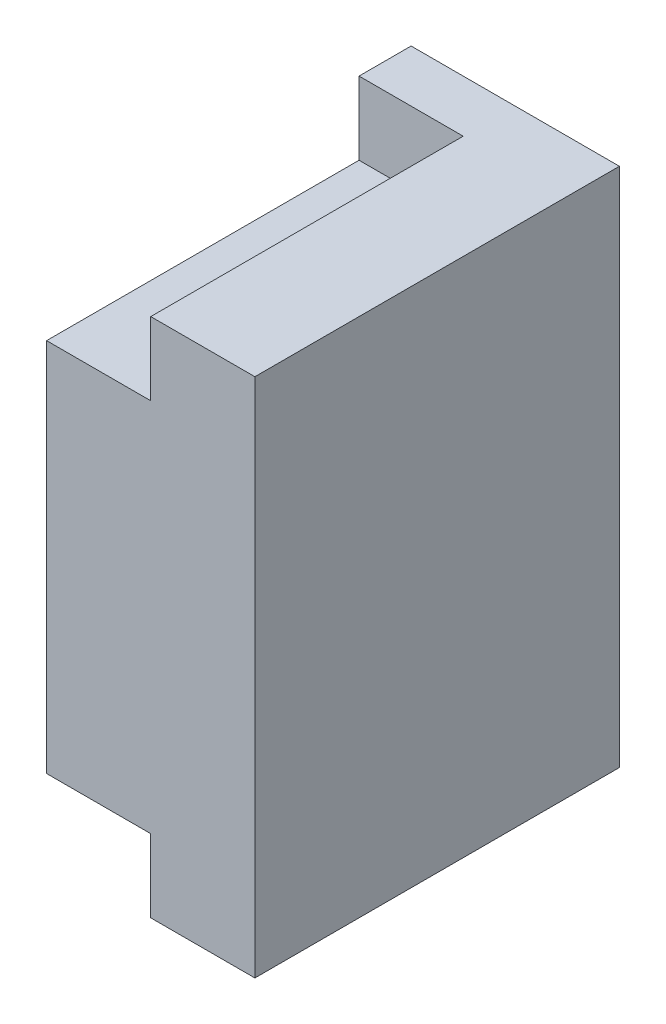
ISO-10303-21;
HEADER;
FILE_DESCRIPTION(('STEP AP214'),'2;1');
FILE_NAME('part.step','',(''),(''),'','','');
FILE_SCHEMA(('AUTOMOTIVE_DESIGN { 1 0 10303 214 1 1 1 1 }'));
ENDSEC;
DATA;
#1=APPLICATION_CONTEXT('core data for automotive mechanical design processes');
#2=APPLICATION_PROTOCOL_DEFINITION('international standard','automotive_design',2000,#1);
#3=PRODUCT_CONTEXT('',#1,'mechanical');
#4=PRODUCT('Part','Part','',(#3));
#5=PRODUCT_RELATED_PRODUCT_CATEGORY('part','',(#4));
#6=PRODUCT_DEFINITION_FORMATION('','',#4);
#7=PRODUCT_DEFINITION_CONTEXT('part definition',#1,'design');
#8=PRODUCT_DEFINITION('design','',#6,#7);
#9=PRODUCT_DEFINITION_SHAPE('','',#8);
#10=(LENGTH_UNIT() NAMED_UNIT(*) SI_UNIT(.MILLI.,.METRE.));
#11=(NAMED_UNIT(*) PLANE_ANGLE_UNIT() SI_UNIT($,.RADIAN.));
#12=(NAMED_UNIT(*) SI_UNIT($,.STERADIAN.) SOLID_ANGLE_UNIT());
#13=UNCERTAINTY_MEASURE_WITH_UNIT(LENGTH_MEASURE(1.E-05),#10,'distance_accuracy_value','');
#14=(GEOMETRIC_REPRESENTATION_CONTEXT(3) GLOBAL_UNCERTAINTY_ASSIGNED_CONTEXT((#13)) GLOBAL_UNIT_ASSIGNED_CONTEXT((#10,
#11,#12)) REPRESENTATION_CONTEXT('',''));
#15=CARTESIAN_POINT('',(0.,0.,0.));
#16=DIRECTION('',(0.,0.,1.));
#17=DIRECTION('',(1.,0.,0.));
#18=AXIS2_PLACEMENT_3D('',#15,#16,#17);
#19=CARTESIAN_POINT('',(0.3,-0.25,0.));
#20=DIRECTION('',(1.,0.,0.));
#21=DIRECTION('',(0.,0.,1.));
#22=AXIS2_PLACEMENT_3D('',#19,#20,#21);
#23=PLANE('',#22);
#24=DIRECTION('',(0.,-1.,0.));
#25=VECTOR('',#24,1.);
#26=CARTESIAN_POINT('',(0.3,-0.25,0.05));
#27=LINE('',#26,#25);
#28=CARTESIAN_POINT('',(0.3,-0.18,0.05));
#29=VERTEX_POINT('',#28);
#30=CARTESIAN_POINT('',(0.3,-0.25,0.05));
#31=VERTEX_POINT('',#30);
#32=EDGE_CURVE('E11',#29,#31,#27,.T.);
#33=ORIENTED_EDGE('',*,*,#32,.F.);
#34=DIRECTION('',(0.,0.,1.));
#35=VECTOR('',#34,1.);
#36=CARTESIAN_POINT('',(0.3,-0.18,0.025));
#37=LINE('',#36,#35);
#38=CARTESIAN_POINT('',(0.3,-0.18,0.35));
#39=VERTEX_POINT('',#38);
#40=EDGE_CURVE('E24',#29,#39,#37,.T.);
#41=ORIENTED_EDGE('',*,*,#40,.T.);
#42=DIRECTION('',(0.,1.,0.));
#43=VECTOR('',#42,1.);
#44=CARTESIAN_POINT('',(0.3,-0.25,0.35));
#45=LINE('',#44,#43);
#46=CARTESIAN_POINT('',(0.3,0.18,0.35));
#47=VERTEX_POINT('',#46);
#48=EDGE_CURVE('E168',#39,#47,#45,.T.);
#49=ORIENTED_EDGE('',*,*,#48,.T.);
#50=DIRECTION('',(0.,0.,1.));
#51=VECTOR('',#50,1.);
#52=CARTESIAN_POINT('',(0.3,0.18,0.025));
#53=LINE('',#52,#51);
#54=CARTESIAN_POINT('',(0.3,0.18,0.05));
#55=VERTEX_POINT('',#54);
#56=EDGE_CURVE('E166',#55,#47,#53,.T.);
#57=ORIENTED_EDGE('',*,*,#56,.F.);
#58=DIRECTION('',(0.,-1.,0.));
#59=VECTOR('',#58,1.);
#60=CARTESIAN_POINT('',(0.3,-0.035,0.05));
#61=LINE('',#60,#59);
#62=CARTESIAN_POINT('',(0.3,0.25,0.05));
#63=VERTEX_POINT('',#62);
#64=EDGE_CURVE('E164',#63,#55,#61,.T.);
#65=ORIENTED_EDGE('',*,*,#64,.F.);
#66=DIRECTION('',(0.,0.,1.));
#67=VECTOR('',#66,1.);
#68=CARTESIAN_POINT('',(0.3,0.25,0.));
#69=LINE('',#68,#67);
#70=CARTESIAN_POINT('',(0.3,0.25,0.));
#71=VERTEX_POINT('',#70);
#72=EDGE_CURVE('E162',#71,#63,#69,.T.);
#73=ORIENTED_EDGE('',*,*,#72,.F.);
#74=DIRECTION('',(0.,1.,0.));
#75=VECTOR('',#74,1.);
#76=CARTESIAN_POINT('',(0.3,-0.25,0.));
#77=LINE('',#76,#75);
#78=CARTESIAN_POINT('',(0.3,-0.25,0.));
#79=VERTEX_POINT('',#78);
#80=EDGE_CURVE('E109',#79,#71,#77,.T.);
#81=ORIENTED_EDGE('',*,*,#80,.F.);
#82=DIRECTION('',(0.,0.,1.));
#83=VECTOR('',#82,1.);
#84=CARTESIAN_POINT('',(0.3,-0.25,0.));
#85=LINE('',#84,#83);
#86=EDGE_CURVE('E37',#79,#31,#85,.T.);
#87=ORIENTED_EDGE('',*,*,#86,.T.);
#88=EDGE_LOOP('',(#33,#41,#49,#57,#65,#73,#81,#87));
#89=FACE_BOUND('',#88,.T.);
#90=ADVANCED_FACE('F17',(#89),#23,.F.);
#91=CARTESIAN_POINT('',(0.3,-0.25,0.));
#92=DIRECTION('',(0.,1.,0.));
#93=DIRECTION('',(0.,0.,1.));
#94=AXIS2_PLACEMENT_3D('',#91,#92,#93);
#95=PLANE('',#94);
#96=DIRECTION('',(1.,0.,0.));
#97=VECTOR('',#96,1.);
#98=CARTESIAN_POINT('',(0.3,-0.25,0.35));
#99=LINE('',#98,#97);
#100=CARTESIAN_POINT('',(0.4,-0.25,0.35));
#101=VERTEX_POINT('',#100);
#102=CARTESIAN_POINT('',(0.5,-0.25,0.35));
#103=VERTEX_POINT('',#102);
#104=EDGE_CURVE('E157',#101,#103,#99,.T.);
#105=ORIENTED_EDGE('',*,*,#104,.F.);
#106=DIRECTION('',(0.,0.,1.));
#107=VECTOR('',#106,1.);
#108=CARTESIAN_POINT('',(0.4,-0.25,0.05));
#109=LINE('',#108,#107);
#110=CARTESIAN_POINT('',(0.4,-0.25,0.05));
#111=VERTEX_POINT('',#110);
#112=EDGE_CURVE('E155',#111,#101,#109,.T.);
#113=ORIENTED_EDGE('',*,*,#112,.F.);
#114=DIRECTION('',(1.,0.,0.));
#115=VECTOR('',#114,1.);
#116=CARTESIAN_POINT('',(-0.4,-0.25,0.05));
#117=LINE('',#116,#115);
#118=EDGE_CURVE('E153',#31,#111,#117,.T.);
#119=ORIENTED_EDGE('',*,*,#118,.F.);
#120=ORIENTED_EDGE('',*,*,#86,.F.);
#121=DIRECTION('',(1.,0.,0.));
#122=VECTOR('',#121,1.);
#123=CARTESIAN_POINT('',(0.3,-0.25,0.));
#124=LINE('',#123,#122);
#125=CARTESIAN_POINT('',(0.5,-0.25,0.));
#126=VERTEX_POINT('',#125);
#127=EDGE_CURVE('E151',#79,#126,#124,.T.);
#128=ORIENTED_EDGE('',*,*,#127,.T.);
#129=DIRECTION('',(0.,0.,1.));
#130=VECTOR('',#129,1.);
#131=CARTESIAN_POINT('',(0.5,-0.25,0.));
#132=LINE('',#131,#130);
#133=EDGE_CURVE('E114',#126,#103,#132,.T.);
#134=ORIENTED_EDGE('',*,*,#133,.T.);
#135=EDGE_LOOP('',(#105,#113,#119,#120,#128,#134));
#136=FACE_BOUND('',#135,.T.);
#137=ADVANCED_FACE('F192',(#136),#95,.F.);
#138=CARTESIAN_POINT('',(-0.4,-0.25,0.05));
#139=DIRECTION('',(0.,0.,1.));
#140=DIRECTION('',(1.,0.,0.));
#141=AXIS2_PLACEMENT_3D('',#138,#139,#140);
#142=PLANE('',#141);
#143=DIRECTION('',(1.,0.,0.));
#144=VECTOR('',#143,1.);
#145=CARTESIAN_POINT('',(-0.4,-0.18,0.05));
#146=LINE('',#145,#144);
#147=CARTESIAN_POINT('',(0.4,-0.18,0.05));
#148=VERTEX_POINT('',#147);
#149=EDGE_CURVE('E148',#29,#148,#146,.T.);
#150=ORIENTED_EDGE('',*,*,#149,.F.);
#151=ORIENTED_EDGE('',*,*,#32,.T.);
#152=ORIENTED_EDGE('',*,*,#118,.T.);
#153=DIRECTION('',(0.,1.,0.));
#154=VECTOR('',#153,1.);
#155=CARTESIAN_POINT('',(0.4,-0.25,0.05));
#156=LINE('',#155,#154);
#157=EDGE_CURVE('E145',#111,#148,#156,.T.);
#158=ORIENTED_EDGE('',*,*,#157,.T.);
#159=EDGE_LOOP('',(#150,#151,#152,#158));
#160=FACE_BOUND('',#159,.T.);
#161=ADVANCED_FACE('F197',(#160),#142,.T.);
#162=CARTESIAN_POINT('',(-0.4,-0.18,0.05));
#163=DIRECTION('',(0.,1.,0.));
#164=DIRECTION('',(0.,0.,1.));
#165=AXIS2_PLACEMENT_3D('',#162,#163,#164);
#166=PLANE('',#165);
#167=DIRECTION('',(0.,0.,1.));
#168=VECTOR('',#167,1.);
#169=CARTESIAN_POINT('',(0.4,-0.18,0.05));
#170=LINE('',#169,#168);
#171=CARTESIAN_POINT('',(0.4,-0.18,0.35));
#172=VERTEX_POINT('',#171);
#173=EDGE_CURVE('E142',#148,#172,#170,.T.);
#174=ORIENTED_EDGE('',*,*,#173,.T.);
#175=DIRECTION('',(1.,0.,0.));
#176=VECTOR('',#175,1.);
#177=CARTESIAN_POINT('',(-0.4,-0.18,0.35));
#178=LINE('',#177,#176);
#179=EDGE_CURVE('E140',#39,#172,#178,.T.);
#180=ORIENTED_EDGE('',*,*,#179,.F.);
#181=ORIENTED_EDGE('',*,*,#40,.F.);
#182=ORIENTED_EDGE('',*,*,#149,.T.);
#183=EDGE_LOOP('',(#174,#180,#181,#182));
#184=FACE_BOUND('',#183,.T.);
#185=ADVANCED_FACE('F173',(#184),#166,.F.);
#186=CARTESIAN_POINT('',(0.3,-0.25,0.35));
#187=DIRECTION('',(0.,0.,1.));
#188=DIRECTION('',(1.,0.,0.));
#189=AXIS2_PLACEMENT_3D('',#186,#187,#188);
#190=PLANE('',#189);
#191=ORIENTED_EDGE('',*,*,#48,.F.);
#192=ORIENTED_EDGE('',*,*,#179,.T.);
#193=DIRECTION('',(0.,1.,0.));
#194=VECTOR('',#193,1.);
#195=CARTESIAN_POINT('',(0.4,-0.25,0.35));
#196=LINE('',#195,#194);
#197=EDGE_CURVE('E137',#101,#172,#196,.T.);
#198=ORIENTED_EDGE('',*,*,#197,.F.);
#199=ORIENTED_EDGE('',*,*,#104,.T.);
#200=DIRECTION('',(0.,1.,0.));
#201=VECTOR('',#200,1.);
#202=CARTESIAN_POINT('',(0.5,-0.25,0.35));
#203=LINE('',#202,#201);
#204=CARTESIAN_POINT('',(0.5,0.25,0.35));
#205=VERTEX_POINT('',#204);
#206=EDGE_CURVE('E135',#103,#205,#203,.T.);
#207=ORIENTED_EDGE('',*,*,#206,.T.);
#208=DIRECTION('',(1.,0.,0.));
#209=VECTOR('',#208,1.);
#210=CARTESIAN_POINT('',(0.3,0.25,0.35));
#211=LINE('',#210,#209);
#212=CARTESIAN_POINT('',(0.4,0.25,0.35));
#213=VERTEX_POINT('',#212);
#214=EDGE_CURVE('E98',#213,#205,#211,.T.);
#215=ORIENTED_EDGE('',*,*,#214,.F.);
#216=DIRECTION('',(0.,1.,0.));
#217=VECTOR('',#216,1.);
#218=CARTESIAN_POINT('',(0.4,0.18,0.35));
#219=LINE('',#218,#217);
#220=CARTESIAN_POINT('',(0.4,0.18,0.35));
#221=VERTEX_POINT('',#220);
#222=EDGE_CURVE('E131',#221,#213,#219,.T.);
#223=ORIENTED_EDGE('',*,*,#222,.F.);
#224=DIRECTION('',(1.,0.,0.));
#225=VECTOR('',#224,1.);
#226=CARTESIAN_POINT('',(-0.4,0.18,0.35));
#227=LINE('',#226,#225);
#228=EDGE_CURVE('E128',#47,#221,#227,.T.);
#229=ORIENTED_EDGE('',*,*,#228,.F.);
#230=EDGE_LOOP('',(#191,#192,#198,#199,#207,#215,#223,#229));
#231=FACE_BOUND('',#230,.T.);
#232=ADVANCED_FACE('F177',(#231),#190,.T.);
#233=CARTESIAN_POINT('',(-0.4,0.18,0.05));
#234=DIRECTION('',(0.,1.,0.));
#235=DIRECTION('',(0.,0.,1.));
#236=AXIS2_PLACEMENT_3D('',#233,#234,#235);
#237=PLANE('',#236);
#238=DIRECTION('',(1.,0.,0.));
#239=VECTOR('',#238,1.);
#240=CARTESIAN_POINT('',(-0.4,0.18,0.05));
#241=LINE('',#240,#239);
#242=CARTESIAN_POINT('',(0.4,0.18,0.05));
#243=VERTEX_POINT('',#242);
#244=EDGE_CURVE('E126',#55,#243,#241,.T.);
#245=ORIENTED_EDGE('',*,*,#244,.F.);
#246=ORIENTED_EDGE('',*,*,#56,.T.);
#247=ORIENTED_EDGE('',*,*,#228,.T.);
#248=DIRECTION('',(0.,0.,1.));
#249=VECTOR('',#248,1.);
#250=CARTESIAN_POINT('',(0.4,0.18,0.05));
#251=LINE('',#250,#249);
#252=EDGE_CURVE('E123',#243,#221,#251,.T.);
#253=ORIENTED_EDGE('',*,*,#252,.F.);
#254=EDGE_LOOP('',(#245,#246,#247,#253));
#255=FACE_BOUND('',#254,.T.);
#256=ADVANCED_FACE('F181',(#255),#237,.T.);
#257=CARTESIAN_POINT('',(-0.4,0.18,0.05));
#258=DIRECTION('',(0.,0.,1.));
#259=DIRECTION('',(1.,0.,0.));
#260=AXIS2_PLACEMENT_3D('',#257,#258,#259);
#261=PLANE('',#260);
#262=DIRECTION('',(1.,0.,0.));
#263=VECTOR('',#262,1.);
#264=CARTESIAN_POINT('',(-0.4,0.25,0.05));
#265=LINE('',#264,#263);
#266=CARTESIAN_POINT('',(0.4,0.25,0.05));
#267=VERTEX_POINT('',#266);
#268=EDGE_CURVE('E121',#63,#267,#265,.T.);
#269=ORIENTED_EDGE('',*,*,#268,.F.);
#270=ORIENTED_EDGE('',*,*,#64,.T.);
#271=ORIENTED_EDGE('',*,*,#244,.T.);
#272=DIRECTION('',(0.,1.,0.));
#273=VECTOR('',#272,1.);
#274=CARTESIAN_POINT('',(0.4,0.18,0.05));
#275=LINE('',#274,#273);
#276=EDGE_CURVE('E102',#243,#267,#275,.T.);
#277=ORIENTED_EDGE('',*,*,#276,.T.);
#278=EDGE_LOOP('',(#269,#270,#271,#277));
#279=FACE_BOUND('',#278,.T.);
#280=ADVANCED_FACE('F188',(#279),#261,.T.);
#281=CARTESIAN_POINT('',(0.3,0.25,0.));
#282=DIRECTION('',(0.,1.,0.));
#283=DIRECTION('',(0.,0.,1.));
#284=AXIS2_PLACEMENT_3D('',#281,#282,#283);
#285=PLANE('',#284);
#286=DIRECTION('',(0.,0.,1.));
#287=VECTOR('',#286,1.);
#288=CARTESIAN_POINT('',(0.5,0.25,0.));
#289=LINE('',#288,#287);
#290=CARTESIAN_POINT('',(0.5,0.25,0.));
#291=VERTEX_POINT('',#290);
#292=EDGE_CURVE('E93',#291,#205,#289,.T.);
#293=ORIENTED_EDGE('',*,*,#292,.F.);
#294=DIRECTION('',(1.,0.,0.));
#295=VECTOR('',#294,1.);
#296=CARTESIAN_POINT('',(0.3,0.25,0.));
#297=LINE('',#296,#295);
#298=EDGE_CURVE('E96',#71,#291,#297,.T.);
#299=ORIENTED_EDGE('',*,*,#298,.F.);
#300=ORIENTED_EDGE('',*,*,#72,.T.);
#301=ORIENTED_EDGE('',*,*,#268,.T.);
#302=DIRECTION('',(0.,0.,1.));
#303=VECTOR('',#302,1.);
#304=CARTESIAN_POINT('',(0.4,0.25,0.05));
#305=LINE('',#304,#303);
#306=EDGE_CURVE('E111',#267,#213,#305,.T.);
#307=ORIENTED_EDGE('',*,*,#306,.T.);
#308=ORIENTED_EDGE('',*,*,#214,.T.);
#309=EDGE_LOOP('',(#293,#299,#300,#301,#307,#308));
#310=FACE_BOUND('',#309,.T.);
#311=ADVANCED_FACE('F95',(#310),#285,.T.);
#312=CARTESIAN_POINT('',(0.3,-0.25,0.));
#313=DIRECTION('',(0.,0.,1.));
#314=DIRECTION('',(1.,0.,0.));
#315=AXIS2_PLACEMENT_3D('',#312,#313,#314);
#316=PLANE('',#315);
#317=ORIENTED_EDGE('',*,*,#298,.T.);
#318=DIRECTION('',(0.,1.,0.));
#319=VECTOR('',#318,1.);
#320=CARTESIAN_POINT('',(0.5,-0.25,0.));
#321=LINE('',#320,#319);
#322=EDGE_CURVE('E108',#126,#291,#321,.T.);
#323=ORIENTED_EDGE('',*,*,#322,.F.);
#324=ORIENTED_EDGE('',*,*,#127,.F.);
#325=ORIENTED_EDGE('',*,*,#80,.T.);
#326=EDGE_LOOP('',(#317,#323,#324,#325));
#327=FACE_BOUND('',#326,.T.);
#328=ADVANCED_FACE('F106',(#327),#316,.F.);
#329=CARTESIAN_POINT('',(0.5,-0.25,0.));
#330=DIRECTION('',(1.,0.,0.));
#331=DIRECTION('',(0.,0.,1.));
#332=AXIS2_PLACEMENT_3D('',#329,#330,#331);
#333=PLANE('',#332);
#334=ORIENTED_EDGE('',*,*,#133,.F.);
#335=ORIENTED_EDGE('',*,*,#322,.T.);
#336=ORIENTED_EDGE('',*,*,#292,.T.);
#337=ORIENTED_EDGE('',*,*,#206,.F.);
#338=EDGE_LOOP('',(#334,#335,#336,#337));
#339=FACE_BOUND('',#338,.T.);
#340=ADVANCED_FACE('F113',(#339),#333,.T.);
#341=CARTESIAN_POINT('',(0.4,-0.25,0.05));
#342=DIRECTION('',(1.,0.,0.));
#343=DIRECTION('',(0.,0.,1.));
#344=AXIS2_PLACEMENT_3D('',#341,#342,#343);
#345=PLANE('',#344);
#346=ORIENTED_EDGE('',*,*,#197,.T.);
#347=ORIENTED_EDGE('',*,*,#173,.F.);
#348=ORIENTED_EDGE('',*,*,#157,.F.);
#349=ORIENTED_EDGE('',*,*,#112,.T.);
#350=EDGE_LOOP('',(#346,#347,#348,#349));
#351=FACE_BOUND('',#350,.T.);
#352=ADVANCED_FACE('F199',(#351),#345,.F.);
#353=CARTESIAN_POINT('',(0.4,0.18,0.05));
#354=DIRECTION('',(1.,0.,0.));
#355=DIRECTION('',(0.,0.,1.));
#356=AXIS2_PLACEMENT_3D('',#353,#354,#355);
#357=PLANE('',#356);
#358=ORIENTED_EDGE('',*,*,#222,.T.);
#359=ORIENTED_EDGE('',*,*,#306,.F.);
#360=ORIENTED_EDGE('',*,*,#276,.F.);
#361=ORIENTED_EDGE('',*,*,#252,.T.);
#362=EDGE_LOOP('',(#358,#359,#360,#361));
#363=FACE_BOUND('',#362,.T.);
#364=ADVANCED_FACE('F184',(#363),#357,.F.);
#365=CLOSED_SHELL('',(#90,#137,#161,#185,#232,#256,#280,#311,#328,#340,#352,#364));
#366=MANIFOLD_SOLID_BREP('B1',#365);
#367=ADVANCED_BREP_SHAPE_REPRESENTATION('',(#18,#366),#14);
#368=SHAPE_DEFINITION_REPRESENTATION(#9,#367);
ENDSEC;
END-ISO-10303-21;
